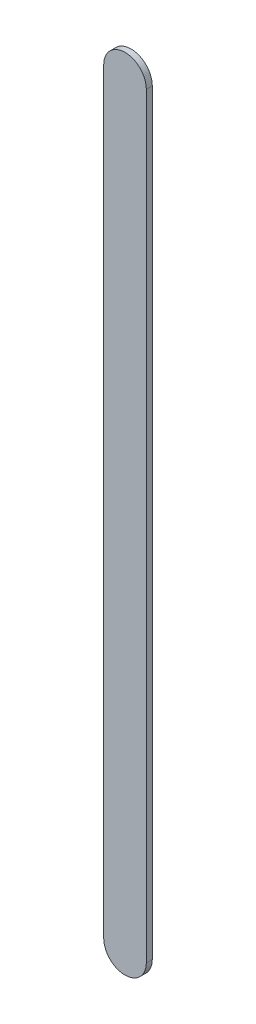
ISO-10303-21;
HEADER;
FILE_DESCRIPTION(('STEP AP214'),'2;1');
FILE_NAME('part.step','',(''),(''),'','','');
FILE_SCHEMA(('AUTOMOTIVE_DESIGN { 1 0 10303 214 1 1 1 1 }'));
ENDSEC;
DATA;
#1=APPLICATION_CONTEXT('core data for automotive mechanical design processes');
#2=APPLICATION_PROTOCOL_DEFINITION('international standard','automotive_design',2000,#1);
#3=PRODUCT_CONTEXT('',#1,'mechanical');
#4=PRODUCT('Part','Part','',(#3));
#5=PRODUCT_RELATED_PRODUCT_CATEGORY('part','',(#4));
#6=PRODUCT_DEFINITION_FORMATION('','',#4);
#7=PRODUCT_DEFINITION_CONTEXT('part definition',#1,'design');
#8=PRODUCT_DEFINITION('design','',#6,#7);
#9=PRODUCT_DEFINITION_SHAPE('','',#8);
#10=(LENGTH_UNIT() NAMED_UNIT(*) SI_UNIT(.MILLI.,.METRE.));
#11=(NAMED_UNIT(*) PLANE_ANGLE_UNIT() SI_UNIT($,.RADIAN.));
#12=(NAMED_UNIT(*) SI_UNIT($,.STERADIAN.) SOLID_ANGLE_UNIT());
#13=UNCERTAINTY_MEASURE_WITH_UNIT(LENGTH_MEASURE(1.E-05),#10,'distance_accuracy_value','');
#14=(GEOMETRIC_REPRESENTATION_CONTEXT(3) GLOBAL_UNCERTAINTY_ASSIGNED_CONTEXT((#13)) GLOBAL_UNIT_ASSIGNED_CONTEXT((#10,
#11,#12)) REPRESENTATION_CONTEXT('',''));
#15=CARTESIAN_POINT('',(0.,0.,0.));
#16=DIRECTION('',(0.,0.,1.));
#17=DIRECTION('',(1.,0.,0.));
#18=AXIS2_PLACEMENT_3D('',#15,#16,#17);
#19=CARTESIAN_POINT('',(96.32194858,52.70493396,0.));
#20=DIRECTION('',(-1.,0.,0.));
#21=DIRECTION('',(0.,1.,0.));
#22=AXIS2_PLACEMENT_3D('',#19,#20,#21);
#23=PLANE('',#22);
#24=DIRECTION('',(0.,1.,0.));
#25=VECTOR('',#24,1.);
#26=CARTESIAN_POINT('',(96.32194858,52.70493396,0.03556));
#27=LINE('',#26,#25);
#28=CARTESIAN_POINT('',(96.32194858,52.70493396,0.03556));
#29=VERTEX_POINT('',#28);
#30=CARTESIAN_POINT('',(96.32194858,57.21499098,0.03556));
#31=VERTEX_POINT('',#30);
#32=EDGE_CURVE('E11',#29,#31,#27,.T.);
#33=ORIENTED_EDGE('',*,*,#32,.F.);
#34=DIRECTION('',(0.,0.,1.));
#35=VECTOR('',#34,1.);
#36=CARTESIAN_POINT('',(96.32194858,52.70493396,0.));
#37=LINE('',#36,#35);
#38=CARTESIAN_POINT('',(96.32194858,52.70493396,0.));
#39=VERTEX_POINT('',#38);
#40=EDGE_CURVE('E24',#39,#29,#37,.T.);
#41=ORIENTED_EDGE('',*,*,#40,.F.);
#42=DIRECTION('',(0.,1.,0.));
#43=VECTOR('',#42,1.);
#44=CARTESIAN_POINT('',(96.32194858,52.70493396,0.));
#45=LINE('',#44,#43);
#46=CARTESIAN_POINT('',(96.32194858,57.21499098,0.));
#47=VERTEX_POINT('',#46);
#48=EDGE_CURVE('E75',#39,#47,#45,.T.);
#49=ORIENTED_EDGE('',*,*,#48,.T.);
#50=DIRECTION('',(0.,0.,1.));
#51=VECTOR('',#50,1.);
#52=CARTESIAN_POINT('',(96.32194858,57.21499098,0.));
#53=LINE('',#52,#51);
#54=EDGE_CURVE('E37',#47,#31,#53,.T.);
#55=ORIENTED_EDGE('',*,*,#54,.T.);
#56=EDGE_LOOP('',(#33,#41,#49,#55));
#57=FACE_BOUND('',#56,.T.);
#58=ADVANCED_FACE('F17',(#57),#23,.F.);
#59=CARTESIAN_POINT('',(96.19494858,57.21499098,0.));
#60=DIRECTION('',(0.,0.,-1.));
#61=DIRECTION('',(1.,0.,0.));
#62=AXIS2_PLACEMENT_3D('',#59,#60,#61);
#63=CYLINDRICAL_SURFACE('',#62,0.127000000000005);
#64=CARTESIAN_POINT('',(96.19494858,57.21499098,0.03556));
#65=DIRECTION('',(0.,0.,1.));
#66=DIRECTION('',(1.,0.,0.));
#67=AXIS2_PLACEMENT_3D('',#64,#65,#66);
#68=CIRCLE('',#67,0.127000000000005);
#69=CARTESIAN_POINT('',(96.06794858,57.21499098,0.03556));
#70=VERTEX_POINT('',#69);
#71=EDGE_CURVE('E83',#31,#70,#68,.T.);
#72=ORIENTED_EDGE('',*,*,#71,.F.);
#73=ORIENTED_EDGE('',*,*,#54,.F.);
#74=CARTESIAN_POINT('',(96.19494858,57.21499098,0.));
#75=DIRECTION('',(0.,0.,1.));
#76=DIRECTION('',(1.,0.,0.));
#77=AXIS2_PLACEMENT_3D('',#74,#75,#76);
#78=CIRCLE('',#77,0.127000000000005);
#79=CARTESIAN_POINT('',(96.06794858,57.21499098,0.));
#80=VERTEX_POINT('',#79);
#81=EDGE_CURVE('E81',#47,#80,#78,.T.);
#82=ORIENTED_EDGE('',*,*,#81,.T.);
#83=DIRECTION('',(0.,0.,1.));
#84=VECTOR('',#83,1.);
#85=CARTESIAN_POINT('',(96.06794858,57.21499098,0.));
#86=LINE('',#85,#84);
#87=EDGE_CURVE('E67',#80,#70,#86,.T.);
#88=ORIENTED_EDGE('',*,*,#87,.T.);
#89=EDGE_LOOP('',(#72,#73,#82,#88));
#90=FACE_BOUND('',#89,.T.);
#91=ADVANCED_FACE('F89',(#90),#63,.T.);
#92=CARTESIAN_POINT('',(96.06794858,57.21499098,0.));
#93=DIRECTION('',(1.,0.,0.));
#94=DIRECTION('',(0.,-1.,0.));
#95=AXIS2_PLACEMENT_3D('',#92,#93,#94);
#96=PLANE('',#95);
#97=DIRECTION('',(0.,-1.,0.));
#98=VECTOR('',#97,1.);
#99=CARTESIAN_POINT('',(96.06794858,57.21499098,0.03556));
#100=LINE('',#99,#98);
#101=CARTESIAN_POINT('',(96.06794858,52.70493396,0.03556));
#102=VERTEX_POINT('',#101);
#103=EDGE_CURVE('E71',#70,#102,#100,.T.);
#104=ORIENTED_EDGE('',*,*,#103,.F.);
#105=ORIENTED_EDGE('',*,*,#87,.F.);
#106=DIRECTION('',(0.,-1.,0.));
#107=VECTOR('',#106,1.);
#108=CARTESIAN_POINT('',(96.06794858,57.21499098,0.));
#109=LINE('',#108,#107);
#110=CARTESIAN_POINT('',(96.06794858,52.70493396,0.));
#111=VERTEX_POINT('',#110);
#112=EDGE_CURVE('E63',#80,#111,#109,.T.);
#113=ORIENTED_EDGE('',*,*,#112,.T.);
#114=DIRECTION('',(0.,0.,1.));
#115=VECTOR('',#114,1.);
#116=CARTESIAN_POINT('',(96.06794858,52.70493396,0.));
#117=LINE('',#116,#115);
#118=EDGE_CURVE('E53',#111,#102,#117,.T.);
#119=ORIENTED_EDGE('',*,*,#118,.T.);
#120=EDGE_LOOP('',(#104,#105,#113,#119));
#121=FACE_BOUND('',#120,.T.);
#122=ADVANCED_FACE('F66',(#121),#96,.F.);
#123=CARTESIAN_POINT('',(96.19494858,52.70493396,0.));
#124=DIRECTION('',(0.,0.,-1.));
#125=DIRECTION('',(-1.,0.,0.));
#126=AXIS2_PLACEMENT_3D('',#123,#124,#125);
#127=CYLINDRICAL_SURFACE('',#126,0.127000000000005);
#128=CARTESIAN_POINT('',(96.19494858,52.70493396,0.03556));
#129=DIRECTION('',(0.,0.,1.));
#130=DIRECTION('',(-1.,0.,0.));
#131=AXIS2_PLACEMENT_3D('',#128,#129,#130);
#132=CIRCLE('',#131,0.127000000000005);
#133=EDGE_CURVE('E59',#102,#29,#132,.T.);
#134=ORIENTED_EDGE('',*,*,#133,.F.);
#135=ORIENTED_EDGE('',*,*,#118,.F.);
#136=CARTESIAN_POINT('',(96.19494858,52.70493396,0.));
#137=DIRECTION('',(0.,0.,1.));
#138=DIRECTION('',(-1.,0.,0.));
#139=AXIS2_PLACEMENT_3D('',#136,#137,#138);
#140=CIRCLE('',#139,0.127000000000005);
#141=EDGE_CURVE('E57',#111,#39,#140,.T.);
#142=ORIENTED_EDGE('',*,*,#141,.T.);
#143=ORIENTED_EDGE('',*,*,#40,.T.);
#144=EDGE_LOOP('',(#134,#135,#142,#143));
#145=FACE_BOUND('',#144,.T.);
#146=ADVANCED_FACE('F55',(#145),#127,.T.);
#147=CARTESIAN_POINT('',(96.32194858,52.70493396,0.));
#148=DIRECTION('',(0.,0.,-1.));
#149=DIRECTION('',(-1.,0.,0.));
#150=AXIS2_PLACEMENT_3D('',#147,#148,#149);
#151=PLANE('',#150);
#152=ORIENTED_EDGE('',*,*,#141,.F.);
#153=ORIENTED_EDGE('',*,*,#112,.F.);
#154=ORIENTED_EDGE('',*,*,#81,.F.);
#155=ORIENTED_EDGE('',*,*,#48,.F.);
#156=EDGE_LOOP('',(#152,#153,#154,#155));
#157=FACE_BOUND('',#156,.T.);
#158=ADVANCED_FACE('F74',(#157),#151,.T.);
#159=CARTESIAN_POINT('',(96.32194858,52.70493396,0.03556));
#160=DIRECTION('',(0.,0.,-1.));
#161=DIRECTION('',(-1.,0.,0.));
#162=AXIS2_PLACEMENT_3D('',#159,#160,#161);
#163=PLANE('',#162);
#164=ORIENTED_EDGE('',*,*,#32,.T.);
#165=ORIENTED_EDGE('',*,*,#71,.T.);
#166=ORIENTED_EDGE('',*,*,#103,.T.);
#167=ORIENTED_EDGE('',*,*,#133,.T.);
#168=EDGE_LOOP('',(#164,#165,#166,#167));
#169=FACE_BOUND('',#168,.T.);
#170=ADVANCED_FACE('F91',(#169),#163,.F.);
#171=CLOSED_SHELL('',(#58,#91,#122,#146,#158,#170));
#172=MANIFOLD_SOLID_BREP('B1',#171);
#173=ADVANCED_BREP_SHAPE_REPRESENTATION('',(#18,#172),#14);
#174=SHAPE_DEFINITION_REPRESENTATION(#9,#173);
ENDSEC;
END-ISO-10303-21;
